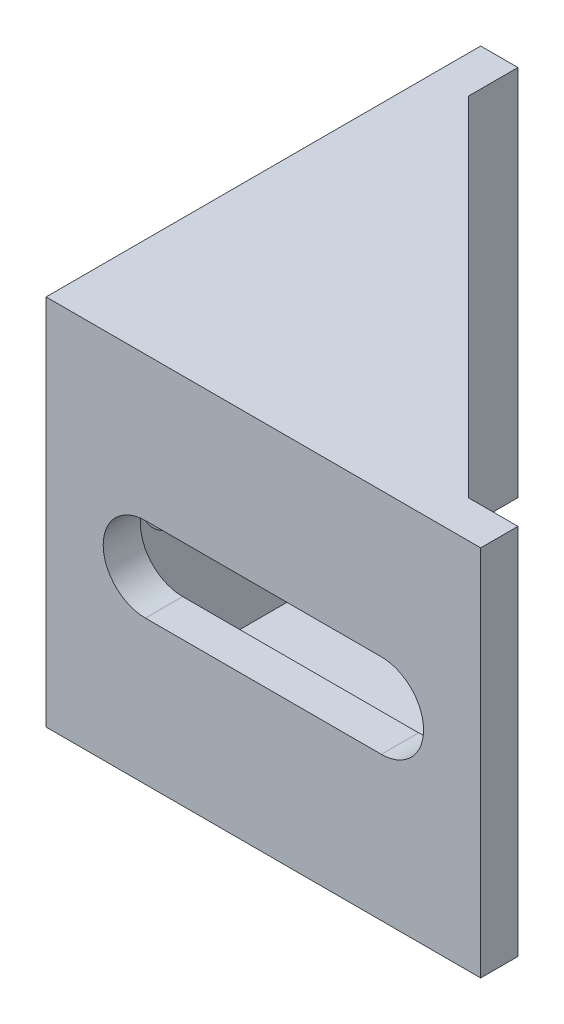
ISO-10303-21;
HEADER;
FILE_DESCRIPTION(('STEP AP214'),'2;1');
FILE_NAME('part.step','',(''),(''),'','','');
FILE_SCHEMA(('AUTOMOTIVE_DESIGN { 1 0 10303 214 1 1 1 1 }'));
ENDSEC;
DATA;
#1=APPLICATION_CONTEXT('core data for automotive mechanical design processes');
#2=APPLICATION_PROTOCOL_DEFINITION('international standard','automotive_design',2000,#1);
#3=PRODUCT_CONTEXT('',#1,'mechanical');
#4=PRODUCT('Part','Part','',(#3));
#5=PRODUCT_RELATED_PRODUCT_CATEGORY('part','',(#4));
#6=PRODUCT_DEFINITION_FORMATION('','',#4);
#7=PRODUCT_DEFINITION_CONTEXT('part definition',#1,'design');
#8=PRODUCT_DEFINITION('design','',#6,#7);
#9=PRODUCT_DEFINITION_SHAPE('','',#8);
#10=(LENGTH_UNIT() NAMED_UNIT(*) SI_UNIT(.MILLI.,.METRE.));
#11=(NAMED_UNIT(*) PLANE_ANGLE_UNIT() SI_UNIT($,.RADIAN.));
#12=(NAMED_UNIT(*) SI_UNIT($,.STERADIAN.) SOLID_ANGLE_UNIT());
#13=UNCERTAINTY_MEASURE_WITH_UNIT(LENGTH_MEASURE(1.E-05),#10,'distance_accuracy_value','');
#14=(GEOMETRIC_REPRESENTATION_CONTEXT(3) GLOBAL_UNCERTAINTY_ASSIGNED_CONTEXT((#13)) GLOBAL_UNIT_ASSIGNED_CONTEXT((#10,
#11,#12)) REPRESENTATION_CONTEXT('',''));
#15=CARTESIAN_POINT('',(0.,0.,0.));
#16=DIRECTION('',(0.,0.,1.));
#17=DIRECTION('',(1.,0.,0.));
#18=AXIS2_PLACEMENT_3D('',#15,#16,#17);
#19=CARTESIAN_POINT('',(35.,26.,0.));
#20=DIRECTION('',(0.,0.,-1.));
#21=DIRECTION('',(-1.,0.,0.));
#22=AXIS2_PLACEMENT_3D('',#19,#20,#21);
#23=PLANE('',#22);
#24=DIRECTION('',(1.,0.,0.));
#25=VECTOR('',#24,1.);
#26=CARTESIAN_POINT('',(27.,16.4,0.));
#27=LINE('',#26,#25);
#28=CARTESIAN_POINT('',(8.,16.4,0.));
#29=VERTEX_POINT('',#28);
#30=CARTESIAN_POINT('',(27.,16.4,0.));
#31=VERTEX_POINT('',#30);
#32=EDGE_CURVE('E206',#29,#31,#27,.T.);
#33=ORIENTED_EDGE('',*,*,#32,.T.);
#34=CARTESIAN_POINT('',(27.,13.,0.));
#35=DIRECTION('',(0.,0.,-1.));
#36=DIRECTION('',(-1.,0.,0.));
#37=AXIS2_PLACEMENT_3D('',#34,#35,#36);
#38=CIRCLE('',#37,3.4);
#39=CARTESIAN_POINT('',(27.,9.6,0.));
#40=VERTEX_POINT('',#39);
#41=EDGE_CURVE('E196',#31,#40,#38,.T.);
#42=ORIENTED_EDGE('',*,*,#41,.T.);
#43=DIRECTION('',(-1.,0.,0.));
#44=VECTOR('',#43,1.);
#45=CARTESIAN_POINT('',(27.,9.6,0.));
#46=LINE('',#45,#44);
#47=CARTESIAN_POINT('',(8.,9.6,0.));
#48=VERTEX_POINT('',#47);
#49=EDGE_CURVE('E199',#40,#48,#46,.T.);
#50=ORIENTED_EDGE('',*,*,#49,.T.);
#51=CARTESIAN_POINT('',(8.,13.,0.));
#52=DIRECTION('',(0.,0.,-1.));
#53=DIRECTION('',(-1.,0.,0.));
#54=AXIS2_PLACEMENT_3D('',#51,#52,#53);
#55=CIRCLE('',#54,3.4);
#56=EDGE_CURVE('E203',#48,#29,#55,.T.);
#57=ORIENTED_EDGE('',*,*,#56,.T.);
#58=EDGE_LOOP('',(#33,#42,#50,#57));
#59=FACE_BOUND('',#58,.T.);
#60=DIRECTION('',(0.,-1.,0.));
#61=VECTOR('',#60,1.);
#62=CARTESIAN_POINT('',(0.,26.,0.));
#63=LINE('',#62,#61);
#64=CARTESIAN_POINT('',(0.,28.,0.));
#65=VERTEX_POINT('',#64);
#66=CARTESIAN_POINT('',(0.,-2.,0.));
#67=VERTEX_POINT('',#66);
#68=EDGE_CURVE('E289',#65,#67,#63,.T.);
#69=ORIENTED_EDGE('',*,*,#68,.T.);
#70=DIRECTION('',(-1.,0.,0.));
#71=VECTOR('',#70,1.);
#72=CARTESIAN_POINT('',(35.,-2.,0.));
#73=LINE('',#72,#71);
#74=CARTESIAN_POINT('',(35.,-2.,0.));
#75=VERTEX_POINT('',#74);
#76=EDGE_CURVE('E228',#75,#67,#73,.T.);
#77=ORIENTED_EDGE('',*,*,#76,.F.);
#78=DIRECTION('',(0.,-1.,0.));
#79=VECTOR('',#78,1.);
#80=CARTESIAN_POINT('',(35.,26.,0.));
#81=LINE('',#80,#79);
#82=CARTESIAN_POINT('',(35.,28.,0.));
#83=VERTEX_POINT('',#82);
#84=EDGE_CURVE('E11',#83,#75,#81,.T.);
#85=ORIENTED_EDGE('',*,*,#84,.F.);
#86=DIRECTION('',(1.,0.,0.));
#87=VECTOR('',#86,1.);
#88=CARTESIAN_POINT('',(0.,28.,0.));
#89=LINE('',#88,#87);
#90=EDGE_CURVE('E264',#65,#83,#89,.T.);
#91=ORIENTED_EDGE('',*,*,#90,.F.);
#92=EDGE_LOOP('',(#69,#77,#85,#91));
#93=FACE_BOUND('',#92,.T.);
#94=ADVANCED_FACE('F36',(#59,#93),#23,.F.);
#95=CARTESIAN_POINT('',(35.,26.,-3.));
#96=DIRECTION('',(-1.,0.,0.));
#97=DIRECTION('',(0.,0.,1.));
#98=AXIS2_PLACEMENT_3D('',#95,#96,#97);
#99=PLANE('',#98);
#100=ORIENTED_EDGE('',*,*,#84,.T.);
#101=DIRECTION('',(0.,0.,1.));
#102=VECTOR('',#101,1.);
#103=CARTESIAN_POINT('',(35.,-2.,-3.));
#104=LINE('',#103,#102);
#105=CARTESIAN_POINT('',(35.,-2.,-3.));
#106=VERTEX_POINT('',#105);
#107=EDGE_CURVE('E244',#106,#75,#104,.T.);
#108=ORIENTED_EDGE('',*,*,#107,.F.);
#109=DIRECTION('',(0.,-1.,0.));
#110=VECTOR('',#109,1.);
#111=CARTESIAN_POINT('',(35.,26.,-3.));
#112=LINE('',#111,#110);
#113=CARTESIAN_POINT('',(35.,28.,-3.));
#114=VERTEX_POINT('',#113);
#115=EDGE_CURVE('E43',#114,#106,#112,.T.);
#116=ORIENTED_EDGE('',*,*,#115,.F.);
#117=DIRECTION('',(0.,0.,-1.));
#118=VECTOR('',#117,1.);
#119=CARTESIAN_POINT('',(35.,28.,0.));
#120=LINE('',#119,#118);
#121=EDGE_CURVE('E267',#83,#114,#120,.T.);
#122=ORIENTED_EDGE('',*,*,#121,.F.);
#123=EDGE_LOOP('',(#100,#108,#116,#122));
#124=FACE_BOUND('',#123,.T.);
#125=ADVANCED_FACE('F314',(#124),#99,.F.);
#126=CARTESIAN_POINT('',(3.,26.,-3.));
#127=DIRECTION('',(0.,0.,1.));
#128=DIRECTION('',(1.,0.,0.));
#129=AXIS2_PLACEMENT_3D('',#126,#127,#128);
#130=PLANE('',#129);
#131=DIRECTION('',(-1.,0.,0.));
#132=VECTOR('',#131,1.);
#133=CARTESIAN_POINT('',(27.,9.6,-3.));
#134=LINE('',#133,#132);
#135=CARTESIAN_POINT('',(27.,9.6,-3.));
#136=VERTEX_POINT('',#135);
#137=CARTESIAN_POINT('',(8.,9.6,-3.));
#138=VERTEX_POINT('',#137);
#139=EDGE_CURVE('E211',#136,#138,#134,.T.);
#140=ORIENTED_EDGE('',*,*,#139,.F.);
#141=CARTESIAN_POINT('',(27.,13.,-3.));
#142=DIRECTION('',(0.,0.,-1.));
#143=DIRECTION('',(-1.,0.,0.));
#144=AXIS2_PLACEMENT_3D('',#141,#142,#143);
#145=CIRCLE('',#144,3.4);
#146=CARTESIAN_POINT('',(27.,16.4,-3.));
#147=VERTEX_POINT('',#146);
#148=EDGE_CURVE('E192',#147,#136,#145,.T.);
#149=ORIENTED_EDGE('',*,*,#148,.F.);
#150=DIRECTION('',(1.,0.,0.));
#151=VECTOR('',#150,1.);
#152=CARTESIAN_POINT('',(27.,16.4,-3.));
#153=LINE('',#152,#151);
#154=CARTESIAN_POINT('',(8.,16.4,-3.));
#155=VERTEX_POINT('',#154);
#156=EDGE_CURVE('E200',#155,#147,#153,.T.);
#157=ORIENTED_EDGE('',*,*,#156,.F.);
#158=CARTESIAN_POINT('',(8.,13.,-3.));
#159=DIRECTION('',(0.,0.,-1.));
#160=DIRECTION('',(-1.,0.,0.));
#161=AXIS2_PLACEMENT_3D('',#158,#159,#160);
#162=CIRCLE('',#161,3.4);
#163=EDGE_CURVE('E214',#138,#155,#162,.T.);
#164=ORIENTED_EDGE('',*,*,#163,.F.);
#165=EDGE_LOOP('',(#140,#149,#157,#164));
#166=FACE_BOUND('',#165,.T.);
#167=ORIENTED_EDGE('',*,*,#115,.T.);
#168=DIRECTION('',(1.,0.,0.));
#169=VECTOR('',#168,1.);
#170=CARTESIAN_POINT('',(31.,-2.,-3.));
#171=LINE('',#170,#169);
#172=CARTESIAN_POINT('',(31.,-2.,-3.));
#173=VERTEX_POINT('',#172);
#174=EDGE_CURVE('E241',#173,#106,#171,.T.);
#175=ORIENTED_EDGE('',*,*,#174,.F.);
#176=DIRECTION('',(0.,1.,0.));
#177=VECTOR('',#176,1.);
#178=CARTESIAN_POINT('',(31.,-2.,-3.));
#179=LINE('',#178,#177);
#180=CARTESIAN_POINT('',(31.,0.,-3.));
#181=VERTEX_POINT('',#180);
#182=EDGE_CURVE('E247',#173,#181,#179,.T.);
#183=ORIENTED_EDGE('',*,*,#182,.T.);
#184=DIRECTION('',(-1.,0.,0.));
#185=VECTOR('',#184,1.);
#186=CARTESIAN_POINT('',(3.,0.,-3.));
#187=LINE('',#186,#185);
#188=CARTESIAN_POINT('',(3.,0.,-3.));
#189=VERTEX_POINT('',#188);
#190=EDGE_CURVE('E282',#181,#189,#187,.T.);
#191=ORIENTED_EDGE('',*,*,#190,.T.);
#192=DIRECTION('',(0.,-1.,0.));
#193=VECTOR('',#192,1.);
#194=CARTESIAN_POINT('',(3.,26.,-3.));
#195=LINE('',#194,#193);
#196=CARTESIAN_POINT('',(3.,26.,-3.));
#197=VERTEX_POINT('',#196);
#198=EDGE_CURVE('E299',#197,#189,#195,.T.);
#199=ORIENTED_EDGE('',*,*,#198,.F.);
#200=DIRECTION('',(-1.,0.,0.));
#201=VECTOR('',#200,1.);
#202=CARTESIAN_POINT('',(3.,26.,-3.));
#203=LINE('',#202,#201);
#204=CARTESIAN_POINT('',(31.,26.,-3.));
#205=VERTEX_POINT('',#204);
#206=EDGE_CURVE('E283',#205,#197,#203,.T.);
#207=ORIENTED_EDGE('',*,*,#206,.F.);
#208=DIRECTION('',(0.,-1.,0.));
#209=VECTOR('',#208,1.);
#210=CARTESIAN_POINT('',(31.,28.,-3.));
#211=LINE('',#210,#209);
#212=CARTESIAN_POINT('',(31.,28.,-3.));
#213=VERTEX_POINT('',#212);
#214=EDGE_CURVE('E279',#213,#205,#211,.T.);
#215=ORIENTED_EDGE('',*,*,#214,.F.);
#216=DIRECTION('',(-1.,0.,0.));
#217=VECTOR('',#216,1.);
#218=CARTESIAN_POINT('',(35.,28.,-3.));
#219=LINE('',#218,#217);
#220=EDGE_CURVE('E270',#114,#213,#219,.T.);
#221=ORIENTED_EDGE('',*,*,#220,.F.);
#222=EDGE_LOOP('',(#167,#175,#183,#191,#199,#207,#215,#221));
#223=FACE_BOUND('',#222,.T.);
#224=ADVANCED_FACE('F304',(#166,#223),#130,.F.);
#225=CARTESIAN_POINT('',(3.,26.,-35.));
#226=DIRECTION('',(-1.,0.,0.));
#227=DIRECTION('',(0.,0.,1.));
#228=AXIS2_PLACEMENT_3D('',#225,#226,#227);
#229=PLANE('',#228);
#230=DIRECTION('',(0.,0.,-1.));
#231=VECTOR('',#230,1.);
#232=CARTESIAN_POINT('',(3.,9.59999999999999,-8.));
#233=LINE('',#232,#231);
#234=CARTESIAN_POINT('',(3.,9.59999999999999,-8.00000000000001));
#235=VERTEX_POINT('',#234);
#236=CARTESIAN_POINT('',(3.,9.6,-27.));
#237=VERTEX_POINT('',#236);
#238=EDGE_CURVE('E186',#235,#237,#233,.T.);
#239=ORIENTED_EDGE('',*,*,#238,.F.);
#240=CARTESIAN_POINT('',(3.,13.,-8.));
#241=DIRECTION('',(1.,0.,0.));
#242=DIRECTION('',(0.,0.,-1.));
#243=AXIS2_PLACEMENT_3D('',#240,#241,#242);
#244=CIRCLE('',#243,3.4);
#245=CARTESIAN_POINT('',(3.,16.4,-8.));
#246=VERTEX_POINT('',#245);
#247=EDGE_CURVE('E50',#246,#235,#244,.T.);
#248=ORIENTED_EDGE('',*,*,#247,.F.);
#249=DIRECTION('',(0.,0.,1.));
#250=VECTOR('',#249,1.);
#251=CARTESIAN_POINT('',(3.,16.4,-8.));
#252=LINE('',#251,#250);
#253=CARTESIAN_POINT('',(3.,16.4,-27.));
#254=VERTEX_POINT('',#253);
#255=EDGE_CURVE('E177',#254,#246,#252,.T.);
#256=ORIENTED_EDGE('',*,*,#255,.F.);
#257=CARTESIAN_POINT('',(3.,13.,-27.));
#258=DIRECTION('',(1.,0.,0.));
#259=DIRECTION('',(0.,0.,-1.));
#260=AXIS2_PLACEMENT_3D('',#257,#258,#259);
#261=CIRCLE('',#260,3.4);
#262=EDGE_CURVE('E180',#237,#254,#261,.T.);
#263=ORIENTED_EDGE('',*,*,#262,.F.);
#264=EDGE_LOOP('',(#239,#248,#256,#263));
#265=FACE_BOUND('',#264,.T.);
#266=DIRECTION('',(0.,0.,-1.));
#267=VECTOR('',#266,1.);
#268=CARTESIAN_POINT('',(3.,0.,-35.));
#269=LINE('',#268,#267);
#270=CARTESIAN_POINT('',(2.99999999999999,0.,-31.));
#271=VERTEX_POINT('',#270);
#272=EDGE_CURVE('E287',#189,#271,#269,.T.);
#273=ORIENTED_EDGE('',*,*,#272,.T.);
#274=DIRECTION('',(0.,1.,0.));
#275=VECTOR('',#274,1.);
#276=CARTESIAN_POINT('',(2.99999999999999,-2.,-31.));
#277=LINE('',#276,#275);
#278=CARTESIAN_POINT('',(2.99999999999999,-2.,-31.));
#279=VERTEX_POINT('',#278);
#280=EDGE_CURVE('E252',#279,#271,#277,.T.);
#281=ORIENTED_EDGE('',*,*,#280,.F.);
#282=DIRECTION('',(0.,0.,1.));
#283=VECTOR('',#282,1.);
#284=CARTESIAN_POINT('',(3.,-2.,-35.));
#285=LINE('',#284,#283);
#286=CARTESIAN_POINT('',(3.,-2.,-35.));
#287=VERTEX_POINT('',#286);
#288=EDGE_CURVE('E237',#287,#279,#285,.T.);
#289=ORIENTED_EDGE('',*,*,#288,.F.);
#290=DIRECTION('',(0.,-1.,0.));
#291=VECTOR('',#290,1.);
#292=CARTESIAN_POINT('',(3.,26.,-35.));
#293=LINE('',#292,#291);
#294=CARTESIAN_POINT('',(3.,28.,-35.));
#295=VERTEX_POINT('',#294);
#296=EDGE_CURVE('E297',#295,#287,#293,.T.);
#297=ORIENTED_EDGE('',*,*,#296,.F.);
#298=DIRECTION('',(0.,0.,-1.));
#299=VECTOR('',#298,1.);
#300=CARTESIAN_POINT('',(3.,28.,-31.));
#301=LINE('',#300,#299);
#302=CARTESIAN_POINT('',(3.,28.,-31.));
#303=VERTEX_POINT('',#302);
#304=EDGE_CURVE('E255',#303,#295,#301,.T.);
#305=ORIENTED_EDGE('',*,*,#304,.F.);
#306=DIRECTION('',(0.,-1.,0.));
#307=VECTOR('',#306,1.);
#308=CARTESIAN_POINT('',(3.,28.,-31.));
#309=LINE('',#308,#307);
#310=CARTESIAN_POINT('',(2.99999999999999,26.,-31.));
#311=VERTEX_POINT('',#310);
#312=EDGE_CURVE('E274',#303,#311,#309,.T.);
#313=ORIENTED_EDGE('',*,*,#312,.T.);
#314=DIRECTION('',(0.,0.,-1.));
#315=VECTOR('',#314,1.);
#316=CARTESIAN_POINT('',(3.,26.,-35.));
#317=LINE('',#316,#315);
#318=EDGE_CURVE('E286',#197,#311,#317,.T.);
#319=ORIENTED_EDGE('',*,*,#318,.F.);
#320=ORIENTED_EDGE('',*,*,#198,.T.);
#321=EDGE_LOOP('',(#273,#281,#289,#297,#305,#313,#319,#320));
#322=FACE_BOUND('',#321,.T.);
#323=ADVANCED_FACE('F328',(#265,#322),#229,.F.);
#324=CARTESIAN_POINT('',(0.,26.,-35.));
#325=DIRECTION('',(0.,0.,1.));
#326=DIRECTION('',(1.,0.,0.));
#327=AXIS2_PLACEMENT_3D('',#324,#325,#326);
#328=PLANE('',#327);
#329=ORIENTED_EDGE('',*,*,#296,.T.);
#330=DIRECTION('',(1.,0.,0.));
#331=VECTOR('',#330,1.);
#332=CARTESIAN_POINT('',(0.,-2.,-35.));
#333=LINE('',#332,#331);
#334=CARTESIAN_POINT('',(0.,-2.,-35.));
#335=VERTEX_POINT('',#334);
#336=EDGE_CURVE('E234',#335,#287,#333,.T.);
#337=ORIENTED_EDGE('',*,*,#336,.F.);
#338=DIRECTION('',(0.,-1.,0.));
#339=VECTOR('',#338,1.);
#340=CARTESIAN_POINT('',(0.,26.,-35.));
#341=LINE('',#340,#339);
#342=CARTESIAN_POINT('',(0.,28.,-35.));
#343=VERTEX_POINT('',#342);
#344=EDGE_CURVE('E295',#343,#335,#341,.T.);
#345=ORIENTED_EDGE('',*,*,#344,.F.);
#346=DIRECTION('',(-1.,0.,0.));
#347=VECTOR('',#346,1.);
#348=CARTESIAN_POINT('',(3.,28.,-35.));
#349=LINE('',#348,#347);
#350=EDGE_CURVE('E258',#295,#343,#349,.T.);
#351=ORIENTED_EDGE('',*,*,#350,.F.);
#352=EDGE_LOOP('',(#329,#337,#345,#351));
#353=FACE_BOUND('',#352,.T.);
#354=ADVANCED_FACE('F325',(#353),#328,.F.);
#355=CARTESIAN_POINT('',(0.,26.,0.));
#356=DIRECTION('',(1.,0.,0.));
#357=DIRECTION('',(0.,0.,-1.));
#358=AXIS2_PLACEMENT_3D('',#355,#356,#357);
#359=PLANE('',#358);
#360=DIRECTION('',(0.,0.,1.));
#361=VECTOR('',#360,1.);
#362=CARTESIAN_POINT('',(0.,16.4,-8.));
#363=LINE('',#362,#361);
#364=CARTESIAN_POINT('',(0.,16.4,-27.));
#365=VERTEX_POINT('',#364);
#366=CARTESIAN_POINT('',(0.,16.4,-8.));
#367=VERTEX_POINT('',#366);
#368=EDGE_CURVE('E167',#365,#367,#363,.T.);
#369=ORIENTED_EDGE('',*,*,#368,.T.);
#370=CARTESIAN_POINT('',(0.,13.,-8.));
#371=DIRECTION('',(1.,0.,0.));
#372=DIRECTION('',(0.,0.,-1.));
#373=AXIS2_PLACEMENT_3D('',#370,#371,#372);
#374=CIRCLE('',#373,3.4);
#375=CARTESIAN_POINT('',(0.,9.59999999999999,-8.));
#376=VERTEX_POINT('',#375);
#377=EDGE_CURVE('E161',#367,#376,#374,.T.);
#378=ORIENTED_EDGE('',*,*,#377,.T.);
#379=DIRECTION('',(0.,0.,-1.));
#380=VECTOR('',#379,1.);
#381=CARTESIAN_POINT('',(0.,9.59999999999999,-8.));
#382=LINE('',#381,#380);
#383=CARTESIAN_POINT('',(0.,9.6,-27.));
#384=VERTEX_POINT('',#383);
#385=EDGE_CURVE('E170',#376,#384,#382,.T.);
#386=ORIENTED_EDGE('',*,*,#385,.T.);
#387=CARTESIAN_POINT('',(0.,13.,-27.));
#388=DIRECTION('',(1.,0.,0.));
#389=DIRECTION('',(0.,0.,-1.));
#390=AXIS2_PLACEMENT_3D('',#387,#388,#389);
#391=CIRCLE('',#390,3.4);
#392=EDGE_CURVE('E58',#384,#365,#391,.T.);
#393=ORIENTED_EDGE('',*,*,#392,.T.);
#394=EDGE_LOOP('',(#369,#378,#386,#393));
#395=FACE_BOUND('',#394,.T.);
#396=ORIENTED_EDGE('',*,*,#344,.T.);
#397=DIRECTION('',(0.,0.,-1.));
#398=VECTOR('',#397,1.);
#399=CARTESIAN_POINT('',(0.,-2.,0.));
#400=LINE('',#399,#398);
#401=EDGE_CURVE('E231',#67,#335,#400,.T.);
#402=ORIENTED_EDGE('',*,*,#401,.F.);
#403=ORIENTED_EDGE('',*,*,#68,.F.);
#404=DIRECTION('',(0.,0.,1.));
#405=VECTOR('',#404,1.);
#406=CARTESIAN_POINT('',(0.,28.,-35.));
#407=LINE('',#406,#405);
#408=EDGE_CURVE('E261',#343,#65,#407,.T.);
#409=ORIENTED_EDGE('',*,*,#408,.F.);
#410=EDGE_LOOP('',(#396,#402,#403,#409));
#411=FACE_BOUND('',#410,.T.);
#412=ADVANCED_FACE('F174',(#395,#411),#359,.F.);
#413=CARTESIAN_POINT('',(0.,26.,0.));
#414=DIRECTION('',(0.,1.,0.));
#415=DIRECTION('',(0.,0.,1.));
#416=AXIS2_PLACEMENT_3D('',#413,#414,#415);
#417=PLANE('',#416);
#418=DIRECTION('',(-0.707106781186547,0.,-0.707106781186548));
#419=VECTOR('',#418,1.);
#420=CARTESIAN_POINT('',(31.,26.,-3.));
#421=LINE('',#420,#419);
#422=EDGE_CURVE('E254',#205,#311,#421,.T.);
#423=ORIENTED_EDGE('',*,*,#422,.F.);
#424=ORIENTED_EDGE('',*,*,#206,.T.);
#425=ORIENTED_EDGE('',*,*,#318,.T.);
#426=EDGE_LOOP('',(#423,#424,#425));
#427=FACE_BOUND('',#426,.T.);
#428=ADVANCED_FACE('F338',(#427),#417,.F.);
#429=CARTESIAN_POINT('',(31.,28.,-3.));
#430=DIRECTION('',(-0.707106781186548,0.,0.707106781186547));
#431=DIRECTION('',(0.707106781186547,0.,0.707106781186548));
#432=AXIS2_PLACEMENT_3D('',#429,#430,#431);
#433=PLANE('',#432);
#434=ORIENTED_EDGE('',*,*,#422,.T.);
#435=ORIENTED_EDGE('',*,*,#312,.F.);
#436=DIRECTION('',(-0.707106781186547,0.,-0.707106781186548));
#437=VECTOR('',#436,1.);
#438=CARTESIAN_POINT('',(31.,28.,-3.));
#439=LINE('',#438,#437);
#440=EDGE_CURVE('E272',#213,#303,#439,.T.);
#441=ORIENTED_EDGE('',*,*,#440,.F.);
#442=ORIENTED_EDGE('',*,*,#214,.T.);
#443=EDGE_LOOP('',(#434,#435,#441,#442));
#444=FACE_BOUND('',#443,.T.);
#445=ADVANCED_FACE('F341',(#444),#433,.F.);
#446=CARTESIAN_POINT('',(0.,28.,0.));
#447=DIRECTION('',(0.,1.,0.));
#448=DIRECTION('',(0.,0.,1.));
#449=AXIS2_PLACEMENT_3D('',#446,#447,#448);
#450=PLANE('',#449);
#451=ORIENTED_EDGE('',*,*,#304,.T.);
#452=ORIENTED_EDGE('',*,*,#350,.T.);
#453=ORIENTED_EDGE('',*,*,#408,.T.);
#454=ORIENTED_EDGE('',*,*,#90,.T.);
#455=ORIENTED_EDGE('',*,*,#121,.T.);
#456=ORIENTED_EDGE('',*,*,#220,.T.);
#457=ORIENTED_EDGE('',*,*,#440,.T.);
#458=EDGE_LOOP('',(#451,#452,#453,#454,#455,#456,#457));
#459=FACE_BOUND('',#458,.T.);
#460=ADVANCED_FACE('F318',(#459),#450,.T.);
#461=CARTESIAN_POINT('',(2.99999999999999,-2.,-31.));
#462=DIRECTION('',(-0.707106781186548,0.,0.707106781186547));
#463=DIRECTION('',(0.707106781186547,0.,0.707106781186548));
#464=AXIS2_PLACEMENT_3D('',#461,#462,#463);
#465=PLANE('',#464);
#466=DIRECTION('',(0.707106781186547,0.,0.707106781186548));
#467=VECTOR('',#466,1.);
#468=CARTESIAN_POINT('',(2.99999999999999,0.,-31.));
#469=LINE('',#468,#467);
#470=EDGE_CURVE('E221',#271,#181,#469,.T.);
#471=ORIENTED_EDGE('',*,*,#470,.T.);
#472=ORIENTED_EDGE('',*,*,#182,.F.);
#473=DIRECTION('',(0.707106781186547,0.,0.707106781186548));
#474=VECTOR('',#473,1.);
#475=CARTESIAN_POINT('',(2.99999999999999,-2.,-31.));
#476=LINE('',#475,#474);
#477=EDGE_CURVE('E239',#279,#173,#476,.T.);
#478=ORIENTED_EDGE('',*,*,#477,.F.);
#479=ORIENTED_EDGE('',*,*,#280,.T.);
#480=EDGE_LOOP('',(#471,#472,#478,#479));
#481=FACE_BOUND('',#480,.T.);
#482=ADVANCED_FACE('F332',(#481),#465,.F.);
#483=CARTESIAN_POINT('',(0.,-2.,0.));
#484=DIRECTION('',(0.,-1.,0.));
#485=DIRECTION('',(0.,0.,-1.));
#486=AXIS2_PLACEMENT_3D('',#483,#484,#485);
#487=PLANE('',#486);
#488=ORIENTED_EDGE('',*,*,#76,.T.);
#489=ORIENTED_EDGE('',*,*,#401,.T.);
#490=ORIENTED_EDGE('',*,*,#336,.T.);
#491=ORIENTED_EDGE('',*,*,#288,.T.);
#492=ORIENTED_EDGE('',*,*,#477,.T.);
#493=ORIENTED_EDGE('',*,*,#174,.T.);
#494=ORIENTED_EDGE('',*,*,#107,.T.);
#495=EDGE_LOOP('',(#488,#489,#490,#491,#492,#493,#494));
#496=FACE_BOUND('',#495,.T.);
#497=ADVANCED_FACE('F310',(#496),#487,.T.);
#498=CARTESIAN_POINT('',(0.,0.,0.));
#499=DIRECTION('',(0.,-1.,0.));
#500=DIRECTION('',(0.,0.,-1.));
#501=AXIS2_PLACEMENT_3D('',#498,#499,#500);
#502=PLANE('',#501);
#503=ORIENTED_EDGE('',*,*,#272,.F.);
#504=ORIENTED_EDGE('',*,*,#190,.F.);
#505=ORIENTED_EDGE('',*,*,#470,.F.);
#506=EDGE_LOOP('',(#503,#504,#505));
#507=FACE_BOUND('',#506,.T.);
#508=ADVANCED_FACE('F436',(#507),#502,.F.);
#509=CARTESIAN_POINT('',(27.,13.,0.));
#510=DIRECTION('',(0.,0.,-1.));
#511=DIRECTION('',(-1.,0.,0.));
#512=AXIS2_PLACEMENT_3D('',#509,#510,#511);
#513=CYLINDRICAL_SURFACE('',#512,3.4);
#514=ORIENTED_EDGE('',*,*,#148,.T.);
#515=DIRECTION('',(0.,0.,-1.));
#516=VECTOR('',#515,1.);
#517=CARTESIAN_POINT('',(27.,9.6,0.));
#518=LINE('',#517,#516);
#519=EDGE_CURVE('E209',#40,#136,#518,.T.);
#520=ORIENTED_EDGE('',*,*,#519,.F.);
#521=ORIENTED_EDGE('',*,*,#41,.F.);
#522=DIRECTION('',(0.,0.,-1.));
#523=VECTOR('',#522,1.);
#524=CARTESIAN_POINT('',(27.,16.4,0.));
#525=LINE('',#524,#523);
#526=EDGE_CURVE('E219',#31,#147,#525,.T.);
#527=ORIENTED_EDGE('',*,*,#526,.T.);
#528=EDGE_LOOP('',(#514,#520,#521,#527));
#529=FACE_BOUND('',#528,.T.);
#530=ADVANCED_FACE('F363',(#529),#513,.F.);
#531=CARTESIAN_POINT('',(27.,16.4,0.));
#532=DIRECTION('',(0.,1.,0.));
#533=DIRECTION('',(0.,0.,1.));
#534=AXIS2_PLACEMENT_3D('',#531,#532,#533);
#535=PLANE('',#534);
#536=ORIENTED_EDGE('',*,*,#156,.T.);
#537=ORIENTED_EDGE('',*,*,#526,.F.);
#538=ORIENTED_EDGE('',*,*,#32,.F.);
#539=DIRECTION('',(0.,0.,-1.));
#540=VECTOR('',#539,1.);
#541=CARTESIAN_POINT('',(8.,16.4,0.));
#542=LINE('',#541,#540);
#543=EDGE_CURVE('E222',#29,#155,#542,.T.);
#544=ORIENTED_EDGE('',*,*,#543,.T.);
#545=EDGE_LOOP('',(#536,#537,#538,#544));
#546=FACE_BOUND('',#545,.T.);
#547=ADVANCED_FACE('F359',(#546),#535,.F.);
#548=CARTESIAN_POINT('',(8.,13.,0.));
#549=DIRECTION('',(0.,0.,-1.));
#550=DIRECTION('',(-1.,0.,0.));
#551=AXIS2_PLACEMENT_3D('',#548,#549,#550);
#552=CYLINDRICAL_SURFACE('',#551,3.4);
#553=ORIENTED_EDGE('',*,*,#163,.T.);
#554=ORIENTED_EDGE('',*,*,#543,.F.);
#555=ORIENTED_EDGE('',*,*,#56,.F.);
#556=DIRECTION('',(0.,0.,-1.));
#557=VECTOR('',#556,1.);
#558=CARTESIAN_POINT('',(8.,9.6,0.));
#559=LINE('',#558,#557);
#560=EDGE_CURVE('E224',#48,#138,#559,.T.);
#561=ORIENTED_EDGE('',*,*,#560,.T.);
#562=EDGE_LOOP('',(#553,#554,#555,#561));
#563=FACE_BOUND('',#562,.T.);
#564=ADVANCED_FACE('F371',(#563),#552,.F.);
#565=CARTESIAN_POINT('',(27.,9.6,0.));
#566=DIRECTION('',(0.,-1.,0.));
#567=DIRECTION('',(1.,0.,0.));
#568=AXIS2_PLACEMENT_3D('',#565,#566,#567);
#569=PLANE('',#568);
#570=ORIENTED_EDGE('',*,*,#139,.T.);
#571=ORIENTED_EDGE('',*,*,#560,.F.);
#572=ORIENTED_EDGE('',*,*,#49,.F.);
#573=ORIENTED_EDGE('',*,*,#519,.T.);
#574=EDGE_LOOP('',(#570,#571,#572,#573));
#575=FACE_BOUND('',#574,.T.);
#576=ADVANCED_FACE('F368',(#575),#569,.F.);
#577=CARTESIAN_POINT('',(0.,13.,-8.));
#578=DIRECTION('',(1.,0.,0.));
#579=DIRECTION('',(0.,0.,-1.));
#580=AXIS2_PLACEMENT_3D('',#577,#578,#579);
#581=CYLINDRICAL_SURFACE('',#580,3.4);
#582=ORIENTED_EDGE('',*,*,#247,.T.);
#583=DIRECTION('',(1.,0.,0.));
#584=VECTOR('',#583,1.);
#585=CARTESIAN_POINT('',(0.,9.59999999999999,-8.));
#586=LINE('',#585,#584);
#587=EDGE_CURVE('E157',#376,#235,#586,.T.);
#588=ORIENTED_EDGE('',*,*,#587,.F.);
#589=ORIENTED_EDGE('',*,*,#377,.F.);
#590=DIRECTION('',(1.,0.,0.));
#591=VECTOR('',#590,1.);
#592=CARTESIAN_POINT('',(0.,16.4,-8.));
#593=LINE('',#592,#591);
#594=EDGE_CURVE('E190',#367,#246,#593,.T.);
#595=ORIENTED_EDGE('',*,*,#594,.T.);
#596=EDGE_LOOP('',(#582,#588,#589,#595));
#597=FACE_BOUND('',#596,.T.);
#598=ADVANCED_FACE('F159',(#597),#581,.F.);
#599=CARTESIAN_POINT('',(0.,16.4,-8.));
#600=DIRECTION('',(0.,1.,0.));
#601=DIRECTION('',(0.,0.,1.));
#602=AXIS2_PLACEMENT_3D('',#599,#600,#601);
#603=PLANE('',#602);
#604=ORIENTED_EDGE('',*,*,#255,.T.);
#605=ORIENTED_EDGE('',*,*,#594,.F.);
#606=ORIENTED_EDGE('',*,*,#368,.F.);
#607=DIRECTION('',(1.,0.,0.));
#608=VECTOR('',#607,1.);
#609=CARTESIAN_POINT('',(0.,16.4,-27.));
#610=LINE('',#609,#608);
#611=EDGE_CURVE('E193',#365,#254,#610,.T.);
#612=ORIENTED_EDGE('',*,*,#611,.T.);
#613=EDGE_LOOP('',(#604,#605,#606,#612));
#614=FACE_BOUND('',#613,.T.);
#615=ADVANCED_FACE('F529',(#614),#603,.F.);
#616=CARTESIAN_POINT('',(0.,13.,-27.));
#617=DIRECTION('',(1.,0.,0.));
#618=DIRECTION('',(0.,0.,-1.));
#619=AXIS2_PLACEMENT_3D('',#616,#617,#618);
#620=CYLINDRICAL_SURFACE('',#619,3.4);
#621=ORIENTED_EDGE('',*,*,#262,.T.);
#622=ORIENTED_EDGE('',*,*,#611,.F.);
#623=ORIENTED_EDGE('',*,*,#392,.F.);
#624=DIRECTION('',(1.,0.,0.));
#625=VECTOR('',#624,1.);
#626=CARTESIAN_POINT('',(0.,9.6,-27.));
#627=LINE('',#626,#625);
#628=EDGE_CURVE('E166',#384,#237,#627,.T.);
#629=ORIENTED_EDGE('',*,*,#628,.T.);
#630=EDGE_LOOP('',(#621,#622,#623,#629));
#631=FACE_BOUND('',#630,.T.);
#632=ADVANCED_FACE('F535',(#631),#620,.F.);
#633=CARTESIAN_POINT('',(0.,9.59999999999999,-8.));
#634=DIRECTION('',(0.,-1.,0.));
#635=DIRECTION('',(0.,0.,-1.));
#636=AXIS2_PLACEMENT_3D('',#633,#634,#635);
#637=PLANE('',#636);
#638=ORIENTED_EDGE('',*,*,#238,.T.);
#639=ORIENTED_EDGE('',*,*,#628,.F.);
#640=ORIENTED_EDGE('',*,*,#385,.F.);
#641=ORIENTED_EDGE('',*,*,#587,.T.);
#642=EDGE_LOOP('',(#638,#639,#640,#641));
#643=FACE_BOUND('',#642,.T.);
#644=ADVANCED_FACE('F171',(#643),#637,.F.);
#645=CLOSED_SHELL('',(#94,#125,#224,#323,#354,#412,#428,#445,#460,#482,#497,#508,#530,#547,#564,
#576,#598,#615,#632,#644));
#646=MANIFOLD_SOLID_BREP('B2',#645);
#647=ADVANCED_BREP_SHAPE_REPRESENTATION('',(#18,#646),#14);
#648=SHAPE_DEFINITION_REPRESENTATION(#9,#647);
ENDSEC;
END-ISO-10303-21;
